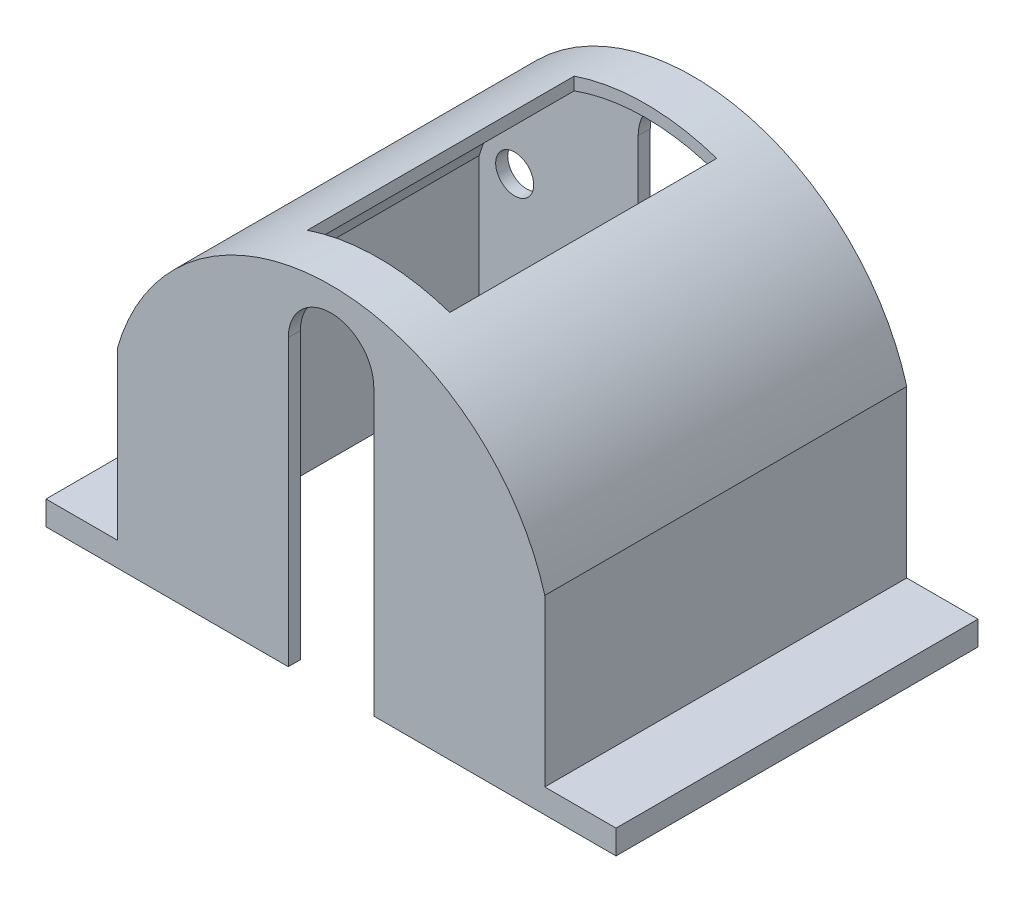
ISO-10303-21;
HEADER;
FILE_DESCRIPTION(('STEP AP214'),'2;1');
FILE_NAME('part.step','',(''),(''),'','','');
FILE_SCHEMA(('AUTOMOTIVE_DESIGN { 1 0 10303 214 1 1 1 1 }'));
ENDSEC;
DATA;
#1=APPLICATION_CONTEXT('core data for automotive mechanical design processes');
#2=APPLICATION_PROTOCOL_DEFINITION('international standard','automotive_design',2000,#1);
#3=PRODUCT_CONTEXT('',#1,'mechanical');
#4=PRODUCT('Part','Part','',(#3));
#5=PRODUCT_RELATED_PRODUCT_CATEGORY('part','',(#4));
#6=PRODUCT_DEFINITION_FORMATION('','',#4);
#7=PRODUCT_DEFINITION_CONTEXT('part definition',#1,'design');
#8=PRODUCT_DEFINITION('design','',#6,#7);
#9=PRODUCT_DEFINITION_SHAPE('','',#8);
#10=(LENGTH_UNIT() NAMED_UNIT(*) SI_UNIT(.MILLI.,.METRE.));
#11=(NAMED_UNIT(*) PLANE_ANGLE_UNIT() SI_UNIT($,.RADIAN.));
#12=(NAMED_UNIT(*) SI_UNIT($,.STERADIAN.) SOLID_ANGLE_UNIT());
#13=UNCERTAINTY_MEASURE_WITH_UNIT(LENGTH_MEASURE(1.E-05),#10,'distance_accuracy_value','');
#14=(GEOMETRIC_REPRESENTATION_CONTEXT(3) GLOBAL_UNCERTAINTY_ASSIGNED_CONTEXT((#13)) GLOBAL_UNIT_ASSIGNED_CONTEXT((#10,
#11,#12)) REPRESENTATION_CONTEXT('',''));
#15=CARTESIAN_POINT('',(0.,0.,0.));
#16=DIRECTION('',(0.,0.,1.));
#17=DIRECTION('',(1.,0.,0.));
#18=AXIS2_PLACEMENT_3D('',#15,#16,#17);
#19=CARTESIAN_POINT('',(-22.5,-20.,38.1));
#20=DIRECTION('',(0.,1.,0.));
#21=DIRECTION('',(0.,0.,1.));
#22=AXIS2_PLACEMENT_3D('',#19,#20,#21);
#23=PLANE('',#22);
#24=DIRECTION('',(0.,0.,-1.));
#25=VECTOR('',#24,1.);
#26=CARTESIAN_POINT('',(-4.5,-20.,38.1));
#27=LINE('',#26,#25);
#28=CARTESIAN_POINT('',(-4.5,-20.,38.1));
#29=VERTEX_POINT('',#28);
#30=CARTESIAN_POINT('',(-4.5,-20.,36.83));
#31=VERTEX_POINT('',#30);
#32=EDGE_CURVE('E293',#29,#31,#27,.T.);
#33=ORIENTED_EDGE('',*,*,#32,.F.);
#34=DIRECTION('',(1.,0.,0.));
#35=VECTOR('',#34,1.);
#36=CARTESIAN_POINT('',(-22.5,-20.,38.1));
#37=LINE('',#36,#35);
#38=CARTESIAN_POINT('',(-30.,-20.,38.1));
#39=VERTEX_POINT('',#38);
#40=EDGE_CURVE('E350',#39,#29,#37,.T.);
#41=ORIENTED_EDGE('',*,*,#40,.F.);
#42=DIRECTION('',(0.,0.,-1.));
#43=VECTOR('',#42,1.);
#44=CARTESIAN_POINT('',(-30.,-20.,38.1));
#45=LINE('',#44,#43);
#46=CARTESIAN_POINT('',(-30.,-20.,0.));
#47=VERTEX_POINT('',#46);
#48=EDGE_CURVE('E225',#39,#47,#45,.T.);
#49=ORIENTED_EDGE('',*,*,#48,.T.);
#50=DIRECTION('',(1.,0.,0.));
#51=VECTOR('',#50,1.);
#52=CARTESIAN_POINT('',(-22.5,-20.,0.));
#53=LINE('',#52,#51);
#54=CARTESIAN_POINT('',(-4.5,-20.,0.));
#55=VERTEX_POINT('',#54);
#56=EDGE_CURVE('E362',#47,#55,#53,.T.);
#57=ORIENTED_EDGE('',*,*,#56,.T.);
#58=CARTESIAN_POINT('',(-4.5,-20.,1.27000000000001));
#59=VERTEX_POINT('',#58);
#60=EDGE_CURVE('E295',#59,#55,#27,.T.);
#61=ORIENTED_EDGE('',*,*,#60,.F.);
#62=DIRECTION('',(1.,0.,0.));
#63=VECTOR('',#62,1.);
#64=CARTESIAN_POINT('',(0.,-20.,1.27));
#65=LINE('',#64,#63);
#66=CARTESIAN_POINT('',(-21.23,-20.,1.27));
#67=VERTEX_POINT('',#66);
#68=EDGE_CURVE('E327',#67,#59,#65,.T.);
#69=ORIENTED_EDGE('',*,*,#68,.F.);
#70=DIRECTION('',(0.,0.,-1.));
#71=VECTOR('',#70,1.);
#72=CARTESIAN_POINT('',(-21.23,-20.,38.1));
#73=LINE('',#72,#71);
#74=CARTESIAN_POINT('',(-21.23,-20.,36.83));
#75=VERTEX_POINT('',#74);
#76=EDGE_CURVE('E316',#75,#67,#73,.T.);
#77=ORIENTED_EDGE('',*,*,#76,.F.);
#78=DIRECTION('',(1.,0.,0.));
#79=VECTOR('',#78,1.);
#80=CARTESIAN_POINT('',(0.,-20.,36.83));
#81=LINE('',#80,#79);
#82=EDGE_CURVE('E330',#75,#31,#81,.T.);
#83=ORIENTED_EDGE('',*,*,#82,.T.);
#84=EDGE_LOOP('',(#33,#41,#49,#57,#61,#69,#77,#83));
#85=FACE_BOUND('',#84,.T.);
#86=ADVANCED_FACE('F35',(#85),#23,.F.);
#87=CARTESIAN_POINT('',(0.,-6.35534140969163,38.1));
#88=DIRECTION('',(0.,0.,-1.));
#89=DIRECTION('',(-1.,0.,0.));
#90=AXIS2_PLACEMENT_3D('',#87,#88,#89);
#91=PLANE('',#90);
#92=DIRECTION('',(0.,-1.,0.));
#93=VECTOR('',#92,1.);
#94=CARTESIAN_POINT('',(-4.5,10.,38.1));
#95=LINE('',#94,#93);
#96=CARTESIAN_POINT('',(-4.5,10.,38.1));
#97=VERTEX_POINT('',#96);
#98=EDGE_CURVE('E278',#97,#29,#95,.T.);
#99=ORIENTED_EDGE('',*,*,#98,.F.);
#100=CARTESIAN_POINT('',(0.,10.,38.1));
#101=DIRECTION('',(0.,0.,-1.));
#102=DIRECTION('',(-1.,0.,0.));
#103=AXIS2_PLACEMENT_3D('',#100,#101,#102);
#104=CIRCLE('',#103,4.5);
#105=CARTESIAN_POINT('',(4.5,10.,38.1));
#106=VERTEX_POINT('',#105);
#107=EDGE_CURVE('E272',#97,#106,#104,.T.);
#108=ORIENTED_EDGE('',*,*,#107,.T.);
#109=DIRECTION('',(0.,-1.,0.));
#110=VECTOR('',#109,1.);
#111=CARTESIAN_POINT('',(4.5,10.,38.1));
#112=LINE('',#111,#110);
#113=CARTESIAN_POINT('',(4.5,-20.,38.1));
#114=VERTEX_POINT('',#113);
#115=EDGE_CURVE('E275',#106,#114,#112,.T.);
#116=ORIENTED_EDGE('',*,*,#115,.T.);
#117=CARTESIAN_POINT('',(30.,-20.,38.1));
#118=VERTEX_POINT('',#117);
#119=EDGE_CURVE('E206',#114,#118,#37,.T.);
#120=ORIENTED_EDGE('',*,*,#119,.T.);
#121=DIRECTION('',(0.,-1.,0.));
#122=VECTOR('',#121,1.);
#123=CARTESIAN_POINT('',(30.,-17.46,38.1));
#124=LINE('',#123,#122);
#125=CARTESIAN_POINT('',(30.,-17.46,38.1));
#126=VERTEX_POINT('',#125);
#127=EDGE_CURVE('E198',#126,#118,#124,.T.);
#128=ORIENTED_EDGE('',*,*,#127,.F.);
#129=DIRECTION('',(-1.,0.,0.));
#130=VECTOR('',#129,1.);
#131=CARTESIAN_POINT('',(30.,-17.46,38.1));
#132=LINE('',#131,#130);
#133=CARTESIAN_POINT('',(22.5,-17.46,38.1));
#134=VERTEX_POINT('',#133);
#135=EDGE_CURVE('E202',#126,#134,#132,.T.);
#136=ORIENTED_EDGE('',*,*,#135,.T.);
#137=DIRECTION('',(0.,1.,0.));
#138=VECTOR('',#137,1.);
#139=CARTESIAN_POINT('',(22.5,-20.,38.1));
#140=LINE('',#139,#138);
#141=CARTESIAN_POINT('',(22.5,0.,38.1));
#142=VERTEX_POINT('',#141);
#143=EDGE_CURVE('E347',#134,#142,#140,.T.);
#144=ORIENTED_EDGE('',*,*,#143,.T.);
#145=CARTESIAN_POINT('',(0.,-6.35534140969163,38.1));
#146=DIRECTION('',(0.,0.,-1.));
#147=DIRECTION('',(-1.,0.,0.));
#148=AXIS2_PLACEMENT_3D('',#145,#146,#147);
#149=CIRCLE('',#148,23.3803414096916);
#150=CARTESIAN_POINT('',(-22.5,0.,38.1));
#151=VERTEX_POINT('',#150);
#152=EDGE_CURVE('E344',#151,#142,#149,.T.);
#153=ORIENTED_EDGE('',*,*,#152,.F.);
#154=DIRECTION('',(0.,-1.,0.));
#155=VECTOR('',#154,1.);
#156=CARTESIAN_POINT('',(-22.5,0.,38.1));
#157=LINE('',#156,#155);
#158=CARTESIAN_POINT('',(-22.5,-17.46,38.1));
#159=VERTEX_POINT('',#158);
#160=EDGE_CURVE('E353',#151,#159,#157,.T.);
#161=ORIENTED_EDGE('',*,*,#160,.T.);
#162=DIRECTION('',(-1.,0.,0.));
#163=VECTOR('',#162,1.);
#164=CARTESIAN_POINT('',(-22.5,-17.46,38.1));
#165=LINE('',#164,#163);
#166=CARTESIAN_POINT('',(-30.,-17.46,38.1));
#167=VERTEX_POINT('',#166);
#168=EDGE_CURVE('E58',#159,#167,#165,.T.);
#169=ORIENTED_EDGE('',*,*,#168,.T.);
#170=DIRECTION('',(0.,-1.,0.));
#171=VECTOR('',#170,1.);
#172=CARTESIAN_POINT('',(-30.,-17.46,38.1));
#173=LINE('',#172,#171);
#174=EDGE_CURVE('E236',#167,#39,#173,.T.);
#175=ORIENTED_EDGE('',*,*,#174,.T.);
#176=ORIENTED_EDGE('',*,*,#40,.T.);
#177=EDGE_LOOP('',(#99,#108,#116,#120,#128,#136,#144,#153,#161,#169,#175,#176));
#178=FACE_BOUND('',#177,.T.);
#179=ADVANCED_FACE('F201',(#178),#91,.F.);
#180=CARTESIAN_POINT('',(0.,-6.35534140969163,0.));
#181=DIRECTION('',(0.,0.,-1.));
#182=DIRECTION('',(-1.,0.,0.));
#183=AXIS2_PLACEMENT_3D('',#180,#181,#182);
#184=PLANE('',#183);
#185=CARTESIAN_POINT('',(-17.5,0.,0.));
#186=DIRECTION('',(0.,0.,-1.));
#187=DIRECTION('',(-1.,0.,0.));
#188=AXIS2_PLACEMENT_3D('',#185,#186,#187);
#189=CIRCLE('',#188,2.);
#190=CARTESIAN_POINT('',(-19.5,0.,0.));
#191=VERTEX_POINT('',#190);
#192=EDGE_CURVE('E264',#191,#191,#189,.T.);
#193=ORIENTED_EDGE('',*,*,#192,.F.);
#194=EDGE_LOOP('',(#193));
#195=FACE_BOUND('',#194,.T.);
#196=CARTESIAN_POINT('',(17.5,0.,0.));
#197=DIRECTION('',(0.,0.,-1.));
#198=DIRECTION('',(-1.,0.,0.));
#199=AXIS2_PLACEMENT_3D('',#196,#197,#198);
#200=CIRCLE('',#199,2.);
#201=CARTESIAN_POINT('',(15.5,0.,0.));
#202=VERTEX_POINT('',#201);
#203=EDGE_CURVE('E268',#202,#202,#200,.T.);
#204=ORIENTED_EDGE('',*,*,#203,.F.);
#205=EDGE_LOOP('',(#204));
#206=FACE_BOUND('',#205,.T.);
#207=CARTESIAN_POINT('',(0.,10.,0.));
#208=DIRECTION('',(0.,0.,-1.));
#209=DIRECTION('',(-1.,0.,0.));
#210=AXIS2_PLACEMENT_3D('',#207,#208,#209);
#211=CIRCLE('',#210,4.5);
#212=CARTESIAN_POINT('',(-4.5,10.,0.));
#213=VERTEX_POINT('',#212);
#214=CARTESIAN_POINT('',(4.5,10.,0.));
#215=VERTEX_POINT('',#214);
#216=EDGE_CURVE('E281',#213,#215,#211,.T.);
#217=ORIENTED_EDGE('',*,*,#216,.F.);
#218=DIRECTION('',(0.,-1.,0.));
#219=VECTOR('',#218,1.);
#220=CARTESIAN_POINT('',(-4.5,10.,0.));
#221=LINE('',#220,#219);
#222=EDGE_CURVE('E276',#213,#55,#221,.T.);
#223=ORIENTED_EDGE('',*,*,#222,.T.);
#224=ORIENTED_EDGE('',*,*,#56,.F.);
#225=DIRECTION('',(0.,-1.,0.));
#226=VECTOR('',#225,1.);
#227=CARTESIAN_POINT('',(-30.,-17.46,0.));
#228=LINE('',#227,#226);
#229=CARTESIAN_POINT('',(-30.,-17.46,0.));
#230=VERTEX_POINT('',#229);
#231=EDGE_CURVE('E239',#230,#47,#228,.T.);
#232=ORIENTED_EDGE('',*,*,#231,.F.);
#233=DIRECTION('',(1.,0.,0.));
#234=VECTOR('',#233,1.);
#235=CARTESIAN_POINT('',(-22.5,-17.46,0.));
#236=LINE('',#235,#234);
#237=CARTESIAN_POINT('',(-22.5,-17.46,0.));
#238=VERTEX_POINT('',#237);
#239=EDGE_CURVE('E233',#230,#238,#236,.T.);
#240=ORIENTED_EDGE('',*,*,#239,.T.);
#241=DIRECTION('',(0.,-1.,0.));
#242=VECTOR('',#241,1.);
#243=CARTESIAN_POINT('',(-22.5,0.,0.));
#244=LINE('',#243,#242);
#245=CARTESIAN_POINT('',(-22.5,0.,0.));
#246=VERTEX_POINT('',#245);
#247=EDGE_CURVE('E348',#246,#238,#244,.T.);
#248=ORIENTED_EDGE('',*,*,#247,.F.);
#249=CARTESIAN_POINT('',(0.,-6.35534140969163,0.));
#250=DIRECTION('',(0.,0.,-1.));
#251=DIRECTION('',(-1.,0.,0.));
#252=AXIS2_PLACEMENT_3D('',#249,#250,#251);
#253=CIRCLE('',#252,23.3803414096916);
#254=CARTESIAN_POINT('',(22.5,0.,0.));
#255=VERTEX_POINT('',#254);
#256=EDGE_CURVE('E315',#246,#255,#253,.T.);
#257=ORIENTED_EDGE('',*,*,#256,.T.);
#258=DIRECTION('',(0.,1.,0.));
#259=VECTOR('',#258,1.);
#260=CARTESIAN_POINT('',(22.5,-20.,0.));
#261=LINE('',#260,#259);
#262=CARTESIAN_POINT('',(22.5,-17.46,0.));
#263=VERTEX_POINT('',#262);
#264=EDGE_CURVE('E359',#263,#255,#261,.T.);
#265=ORIENTED_EDGE('',*,*,#264,.F.);
#266=DIRECTION('',(1.,0.,0.));
#267=VECTOR('',#266,1.);
#268=CARTESIAN_POINT('',(30.,-17.46,0.));
#269=LINE('',#268,#267);
#270=CARTESIAN_POINT('',(30.,-17.46,0.));
#271=VERTEX_POINT('',#270);
#272=EDGE_CURVE('E50',#263,#271,#269,.T.);
#273=ORIENTED_EDGE('',*,*,#272,.T.);
#274=DIRECTION('',(0.,-1.,0.));
#275=VECTOR('',#274,1.);
#276=CARTESIAN_POINT('',(30.,-17.46,0.));
#277=LINE('',#276,#275);
#278=CARTESIAN_POINT('',(30.,-20.,0.));
#279=VERTEX_POINT('',#278);
#280=EDGE_CURVE('E211',#271,#279,#277,.T.);
#281=ORIENTED_EDGE('',*,*,#280,.T.);
#282=CARTESIAN_POINT('',(4.5,-20.,0.));
#283=VERTEX_POINT('',#282);
#284=EDGE_CURVE('E361',#283,#279,#53,.T.);
#285=ORIENTED_EDGE('',*,*,#284,.F.);
#286=DIRECTION('',(0.,-1.,0.));
#287=VECTOR('',#286,1.);
#288=CARTESIAN_POINT('',(4.5,10.,0.));
#289=LINE('',#288,#287);
#290=EDGE_CURVE('E284',#215,#283,#289,.T.);
#291=ORIENTED_EDGE('',*,*,#290,.F.);
#292=EDGE_LOOP('',(#217,#223,#224,#232,#240,#248,#257,#265,#273,#281,#285,#291));
#293=FACE_BOUND('',#292,.T.);
#294=ADVANCED_FACE('F429',(#195,#206,#293),#184,.T.);
#295=CARTESIAN_POINT('',(0.,-6.35534140969163,36.83));
#296=DIRECTION('',(0.,0.,-1.));
#297=DIRECTION('',(-1.,0.,0.));
#298=AXIS2_PLACEMENT_3D('',#295,#296,#297);
#299=PLANE('',#298);
#300=CARTESIAN_POINT('',(0.,10.,36.83));
#301=DIRECTION('',(0.,0.,-1.));
#302=DIRECTION('',(-1.,0.,0.));
#303=AXIS2_PLACEMENT_3D('',#300,#301,#302);
#304=CIRCLE('',#303,4.5);
#305=CARTESIAN_POINT('',(-4.5,10.,36.83));
#306=VERTEX_POINT('',#305);
#307=CARTESIAN_POINT('',(4.5,10.,36.83));
#308=VERTEX_POINT('',#307);
#309=EDGE_CURVE('E306',#306,#308,#304,.T.);
#310=ORIENTED_EDGE('',*,*,#309,.F.);
#311=DIRECTION('',(0.,-1.,0.));
#312=VECTOR('',#311,1.);
#313=CARTESIAN_POINT('',(-4.5,-6.35534140969163,36.83));
#314=LINE('',#313,#312);
#315=EDGE_CURVE('E303',#306,#31,#314,.T.);
#316=ORIENTED_EDGE('',*,*,#315,.T.);
#317=ORIENTED_EDGE('',*,*,#82,.F.);
#318=DIRECTION('',(0.,-1.,0.));
#319=VECTOR('',#318,1.);
#320=CARTESIAN_POINT('',(-21.23,-6.35534140969163,36.83));
#321=LINE('',#320,#319);
#322=CARTESIAN_POINT('',(-21.23,-0.178424925463868,36.83));
#323=VERTEX_POINT('',#322);
#324=EDGE_CURVE('E325',#323,#75,#321,.T.);
#325=ORIENTED_EDGE('',*,*,#324,.F.);
#326=CARTESIAN_POINT('',(0.,-6.35534140969163,36.83));
#327=DIRECTION('',(0.,0.,-1.));
#328=DIRECTION('',(-1.,0.,0.));
#329=AXIS2_PLACEMENT_3D('',#326,#327,#328);
#330=CIRCLE('',#329,22.1103414096916);
#331=CARTESIAN_POINT('',(21.23,-0.178424925463868,36.83));
#332=VERTEX_POINT('',#331);
#333=EDGE_CURVE('E317',#323,#332,#330,.T.);
#334=ORIENTED_EDGE('',*,*,#333,.T.);
#335=DIRECTION('',(0.,1.,0.));
#336=VECTOR('',#335,1.);
#337=CARTESIAN_POINT('',(21.23,-6.35534140969163,36.83));
#338=LINE('',#337,#336);
#339=CARTESIAN_POINT('',(21.23,-20.,36.83));
#340=VERTEX_POINT('',#339);
#341=EDGE_CURVE('E320',#340,#332,#338,.T.);
#342=ORIENTED_EDGE('',*,*,#341,.F.);
#343=CARTESIAN_POINT('',(4.5,-20.,36.83));
#344=VERTEX_POINT('',#343);
#345=EDGE_CURVE('E332',#344,#340,#81,.T.);
#346=ORIENTED_EDGE('',*,*,#345,.F.);
#347=DIRECTION('',(0.,-1.,0.));
#348=VECTOR('',#347,1.);
#349=CARTESIAN_POINT('',(4.5,-6.35534140969163,36.83));
#350=LINE('',#349,#348);
#351=EDGE_CURVE('E291',#308,#344,#350,.T.);
#352=ORIENTED_EDGE('',*,*,#351,.F.);
#353=EDGE_LOOP('',(#310,#316,#317,#325,#334,#342,#346,#352));
#354=FACE_BOUND('',#353,.T.);
#355=ADVANCED_FACE('F441',(#354),#299,.T.);
#356=CARTESIAN_POINT('',(0.,-6.35534140969163,1.27));
#357=DIRECTION('',(0.,0.,-1.));
#358=DIRECTION('',(-1.,0.,0.));
#359=AXIS2_PLACEMENT_3D('',#356,#357,#358);
#360=PLANE('',#359);
#361=CARTESIAN_POINT('',(-17.5,0.,1.27));
#362=DIRECTION('',(0.,0.,-1.));
#363=DIRECTION('',(-1.,0.,0.));
#364=AXIS2_PLACEMENT_3D('',#361,#362,#363);
#365=CIRCLE('',#364,2.);
#366=CARTESIAN_POINT('',(-19.5,0.,1.27));
#367=VERTEX_POINT('',#366);
#368=EDGE_CURVE('E267',#367,#367,#365,.T.);
#369=ORIENTED_EDGE('',*,*,#368,.T.);
#370=EDGE_LOOP('',(#369));
#371=FACE_BOUND('',#370,.T.);
#372=CARTESIAN_POINT('',(17.5,0.,1.27));
#373=DIRECTION('',(0.,0.,-1.));
#374=DIRECTION('',(-1.,0.,0.));
#375=AXIS2_PLACEMENT_3D('',#372,#373,#374);
#376=CIRCLE('',#375,2.);
#377=CARTESIAN_POINT('',(15.5,0.,1.27));
#378=VERTEX_POINT('',#377);
#379=EDGE_CURVE('E271',#378,#378,#376,.T.);
#380=ORIENTED_EDGE('',*,*,#379,.T.);
#381=EDGE_LOOP('',(#380));
#382=FACE_BOUND('',#381,.T.);
#383=DIRECTION('',(0.,-1.,0.));
#384=VECTOR('',#383,1.);
#385=CARTESIAN_POINT('',(-4.5,-6.35534140969163,1.27));
#386=LINE('',#385,#384);
#387=CARTESIAN_POINT('',(-4.5,10.,1.27000000000001));
#388=VERTEX_POINT('',#387);
#389=EDGE_CURVE('E377',#388,#59,#386,.T.);
#390=ORIENTED_EDGE('',*,*,#389,.F.);
#391=CARTESIAN_POINT('',(0.,10.,1.27));
#392=DIRECTION('',(0.,0.,-1.));
#393=DIRECTION('',(-1.,0.,0.));
#394=AXIS2_PLACEMENT_3D('',#391,#392,#393);
#395=CIRCLE('',#394,4.5);
#396=CARTESIAN_POINT('',(4.5,10.,1.27000000000001));
#397=VERTEX_POINT('',#396);
#398=EDGE_CURVE('E374',#388,#397,#395,.T.);
#399=ORIENTED_EDGE('',*,*,#398,.T.);
#400=DIRECTION('',(0.,-1.,0.));
#401=VECTOR('',#400,1.);
#402=CARTESIAN_POINT('',(4.5,-6.35534140969163,1.27));
#403=LINE('',#402,#401);
#404=CARTESIAN_POINT('',(4.5,-20.,1.27));
#405=VERTEX_POINT('',#404);
#406=EDGE_CURVE('E369',#397,#405,#403,.T.);
#407=ORIENTED_EDGE('',*,*,#406,.T.);
#408=CARTESIAN_POINT('',(21.23,-20.,1.27));
#409=VERTEX_POINT('',#408);
#410=EDGE_CURVE('E335',#405,#409,#65,.T.);
#411=ORIENTED_EDGE('',*,*,#410,.T.);
#412=DIRECTION('',(0.,1.,0.));
#413=VECTOR('',#412,1.);
#414=CARTESIAN_POINT('',(21.23,-6.35534140969163,1.27));
#415=LINE('',#414,#413);
#416=CARTESIAN_POINT('',(21.23,-0.178424925463866,1.27));
#417=VERTEX_POINT('',#416);
#418=EDGE_CURVE('E312',#409,#417,#415,.T.);
#419=ORIENTED_EDGE('',*,*,#418,.T.);
#420=CARTESIAN_POINT('',(0.,-6.35534140969163,1.27));
#421=DIRECTION('',(0.,0.,-1.));
#422=DIRECTION('',(-1.,0.,0.));
#423=AXIS2_PLACEMENT_3D('',#420,#421,#422);
#424=CIRCLE('',#423,22.1103414096916);
#425=CARTESIAN_POINT('',(-21.23,-0.178424925463866,1.27));
#426=VERTEX_POINT('',#425);
#427=EDGE_CURVE('E309',#426,#417,#424,.T.);
#428=ORIENTED_EDGE('',*,*,#427,.F.);
#429=DIRECTION('',(0.,-1.,0.));
#430=VECTOR('',#429,1.);
#431=CARTESIAN_POINT('',(-21.23,-6.35534140969163,1.27));
#432=LINE('',#431,#430);
#433=EDGE_CURVE('E321',#426,#67,#432,.T.);
#434=ORIENTED_EDGE('',*,*,#433,.T.);
#435=ORIENTED_EDGE('',*,*,#68,.T.);
#436=EDGE_LOOP('',(#390,#399,#407,#411,#419,#428,#434,#435));
#437=FACE_BOUND('',#436,.T.);
#438=ADVANCED_FACE('F434',(#371,#382,#437),#360,.F.);
#439=ORIENTED_EDGE('',*,*,#119,.F.);
#440=DIRECTION('',(0.,0.,-1.));
#441=VECTOR('',#440,1.);
#442=CARTESIAN_POINT('',(4.5,-20.,38.1));
#443=LINE('',#442,#441);
#444=EDGE_CURVE('E296',#114,#344,#443,.T.);
#445=ORIENTED_EDGE('',*,*,#444,.T.);
#446=ORIENTED_EDGE('',*,*,#345,.T.);
#447=DIRECTION('',(0.,0.,-1.));
#448=VECTOR('',#447,1.);
#449=CARTESIAN_POINT('',(21.23,-20.,38.1));
#450=LINE('',#449,#448);
#451=EDGE_CURVE('E324',#340,#409,#450,.T.);
#452=ORIENTED_EDGE('',*,*,#451,.T.);
#453=ORIENTED_EDGE('',*,*,#410,.F.);
#454=EDGE_CURVE('E299',#405,#283,#443,.T.);
#455=ORIENTED_EDGE('',*,*,#454,.T.);
#456=ORIENTED_EDGE('',*,*,#284,.T.);
#457=DIRECTION('',(0.,0.,1.));
#458=VECTOR('',#457,1.);
#459=CARTESIAN_POINT('',(30.,-20.,38.1));
#460=LINE('',#459,#458);
#461=EDGE_CURVE('E219',#279,#118,#460,.T.);
#462=ORIENTED_EDGE('',*,*,#461,.T.);
#463=EDGE_LOOP('',(#439,#445,#446,#452,#453,#455,#456,#462));
#464=FACE_BOUND('',#463,.T.);
#465=ADVANCED_FACE('F425',(#464),#23,.F.);
#466=CARTESIAN_POINT('',(0.,-6.35534140969163,38.1));
#467=DIRECTION('',(0.,0.,-1.));
#468=DIRECTION('',(-1.,0.,0.));
#469=AXIS2_PLACEMENT_3D('',#466,#467,#468);
#470=CYLINDRICAL_SURFACE('',#469,23.3803414096916);
#471=CARTESIAN_POINT('',(0.,-6.35534140969163,33.1));
#472=DIRECTION('',(0.,0.,1.));
#473=DIRECTION('',(1.,0.,0.));
#474=AXIS2_PLACEMENT_3D('',#471,#472,#473);
#475=CIRCLE('',#474,23.3803414096916);
#476=CARTESIAN_POINT('',(-7.5,15.7894178898298,33.1));
#477=VERTEX_POINT('',#476);
#478=CARTESIAN_POINT('',(7.5,15.7894178898298,33.1));
#479=VERTEX_POINT('',#478);
#480=EDGE_CURVE('E248',#477,#479,#475,.F.);
#481=ORIENTED_EDGE('',*,*,#480,.F.);
#482=DIRECTION('',(0.,0.,-1.));
#483=VECTOR('',#482,1.);
#484=CARTESIAN_POINT('',(-7.5,15.7894178898298,38.1));
#485=LINE('',#484,#483);
#486=CARTESIAN_POINT('',(-7.49999999999999,15.7894178898298,5.00000000000001));
#487=VERTEX_POINT('',#486);
#488=EDGE_CURVE('E262',#487,#477,#485,.F.);
#489=ORIENTED_EDGE('',*,*,#488,.F.);
#490=CARTESIAN_POINT('',(0.,-6.35534140969163,5.));
#491=DIRECTION('',(0.,0.,-1.));
#492=DIRECTION('',(-1.,0.,0.));
#493=AXIS2_PLACEMENT_3D('',#490,#491,#492);
#494=CIRCLE('',#493,23.3803414096916);
#495=CARTESIAN_POINT('',(7.5,15.7894178898298,5.));
#496=VERTEX_POINT('',#495);
#497=EDGE_CURVE('E260',#496,#487,#494,.F.);
#498=ORIENTED_EDGE('',*,*,#497,.F.);
#499=DIRECTION('',(0.,0.,-1.));
#500=VECTOR('',#499,1.);
#501=CARTESIAN_POINT('',(7.50000000000001,15.7894178898298,38.1));
#502=LINE('',#501,#500);
#503=EDGE_CURVE('E258',#479,#496,#502,.T.);
#504=ORIENTED_EDGE('',*,*,#503,.F.);
#505=EDGE_LOOP('',(#481,#489,#498,#504));
#506=FACE_BOUND('',#505,.T.);
#507=ORIENTED_EDGE('',*,*,#256,.F.);
#508=DIRECTION('',(0.,0.,-1.));
#509=VECTOR('',#508,1.);
#510=CARTESIAN_POINT('',(-22.5,0.,38.1));
#511=LINE('',#510,#509);
#512=EDGE_CURVE('E367',#151,#246,#511,.T.);
#513=ORIENTED_EDGE('',*,*,#512,.F.);
#514=ORIENTED_EDGE('',*,*,#152,.T.);
#515=DIRECTION('',(0.,0.,-1.));
#516=VECTOR('',#515,1.);
#517=CARTESIAN_POINT('',(22.5,0.,38.1));
#518=LINE('',#517,#516);
#519=EDGE_CURVE('E356',#142,#255,#518,.T.);
#520=ORIENTED_EDGE('',*,*,#519,.T.);
#521=EDGE_LOOP('',(#507,#513,#514,#520));
#522=FACE_BOUND('',#521,.T.);
#523=ADVANCED_FACE('F37',(#506,#522),#470,.T.);
#524=CARTESIAN_POINT('',(-22.5,0.,38.1));
#525=DIRECTION('',(1.,0.,0.));
#526=DIRECTION('',(0.,0.,-1.));
#527=AXIS2_PLACEMENT_3D('',#524,#525,#526);
#528=PLANE('',#527);
#529=ORIENTED_EDGE('',*,*,#247,.T.);
#530=DIRECTION('',(0.,0.,1.));
#531=VECTOR('',#530,1.);
#532=CARTESIAN_POINT('',(-22.5,-17.46,38.1));
#533=LINE('',#532,#531);
#534=EDGE_CURVE('E227',#238,#159,#533,.T.);
#535=ORIENTED_EDGE('',*,*,#534,.T.);
#536=ORIENTED_EDGE('',*,*,#160,.F.);
#537=ORIENTED_EDGE('',*,*,#512,.T.);
#538=EDGE_LOOP('',(#529,#535,#536,#537));
#539=FACE_BOUND('',#538,.T.);
#540=ADVANCED_FACE('F440',(#539),#528,.F.);
#541=CARTESIAN_POINT('',(22.5,-20.,38.1));
#542=DIRECTION('',(-1.,0.,0.));
#543=DIRECTION('',(0.,0.,1.));
#544=AXIS2_PLACEMENT_3D('',#541,#542,#543);
#545=PLANE('',#544);
#546=ORIENTED_EDGE('',*,*,#143,.F.);
#547=DIRECTION('',(0.,0.,-1.));
#548=VECTOR('',#547,1.);
#549=CARTESIAN_POINT('',(22.5,-17.46,38.1));
#550=LINE('',#549,#548);
#551=EDGE_CURVE('E215',#134,#263,#550,.T.);
#552=ORIENTED_EDGE('',*,*,#551,.T.);
#553=ORIENTED_EDGE('',*,*,#264,.T.);
#554=ORIENTED_EDGE('',*,*,#519,.F.);
#555=EDGE_LOOP('',(#546,#552,#553,#554));
#556=FACE_BOUND('',#555,.T.);
#557=ADVANCED_FACE('F456',(#556),#545,.F.);
#558=CARTESIAN_POINT('',(0.,-6.35534140969163,38.1));
#559=DIRECTION('',(0.,0.,-1.));
#560=DIRECTION('',(-1.,0.,0.));
#561=AXIS2_PLACEMENT_3D('',#558,#559,#560);
#562=CYLINDRICAL_SURFACE('',#561,22.1103414096916);
#563=CARTESIAN_POINT('',(0.,-6.35534140969163,5.));
#564=DIRECTION('',(0.,0.,-1.));
#565=DIRECTION('',(-1.,0.,0.));
#566=AXIS2_PLACEMENT_3D('',#563,#564,#565);
#567=CIRCLE('',#566,22.1103414096916);
#568=CARTESIAN_POINT('',(7.5,14.4441104401318,5.));
#569=VERTEX_POINT('',#568);
#570=CARTESIAN_POINT('',(-7.49999999999999,14.4441104401318,5.00000000000001));
#571=VERTEX_POINT('',#570);
#572=EDGE_CURVE('E43',#569,#571,#567,.F.);
#573=ORIENTED_EDGE('',*,*,#572,.T.);
#574=DIRECTION('',(0.,0.,-1.));
#575=VECTOR('',#574,1.);
#576=CARTESIAN_POINT('',(-7.5,14.4441104401318,38.1));
#577=LINE('',#576,#575);
#578=CARTESIAN_POINT('',(-7.5,14.4441104401318,33.1));
#579=VERTEX_POINT('',#578);
#580=EDGE_CURVE('E11',#571,#579,#577,.F.);
#581=ORIENTED_EDGE('',*,*,#580,.T.);
#582=CARTESIAN_POINT('',(0.,-6.35534140969163,33.1));
#583=DIRECTION('',(0.,0.,1.));
#584=DIRECTION('',(1.,0.,0.));
#585=AXIS2_PLACEMENT_3D('',#582,#583,#584);
#586=CIRCLE('',#585,22.1103414096916);
#587=CARTESIAN_POINT('',(7.5,14.4441104401318,33.1));
#588=VERTEX_POINT('',#587);
#589=EDGE_CURVE('E379',#579,#588,#586,.F.);
#590=ORIENTED_EDGE('',*,*,#589,.T.);
#591=DIRECTION('',(0.,0.,-1.));
#592=VECTOR('',#591,1.);
#593=CARTESIAN_POINT('',(7.50000000000001,14.4441104401318,38.1));
#594=LINE('',#593,#592);
#595=EDGE_CURVE('E386',#588,#569,#594,.T.);
#596=ORIENTED_EDGE('',*,*,#595,.T.);
#597=EDGE_LOOP('',(#573,#581,#590,#596));
#598=FACE_BOUND('',#597,.T.);
#599=ORIENTED_EDGE('',*,*,#427,.T.);
#600=DIRECTION('',(0.,0.,-1.));
#601=VECTOR('',#600,1.);
#602=CARTESIAN_POINT('',(21.23,-0.178424925463868,36.83));
#603=LINE('',#602,#601);
#604=EDGE_CURVE('E322',#332,#417,#603,.T.);
#605=ORIENTED_EDGE('',*,*,#604,.F.);
#606=ORIENTED_EDGE('',*,*,#333,.F.);
#607=DIRECTION('',(0.,0.,-1.));
#608=VECTOR('',#607,1.);
#609=CARTESIAN_POINT('',(-21.23,-0.178424925463868,36.83));
#610=LINE('',#609,#608);
#611=EDGE_CURVE('E313',#323,#426,#610,.T.);
#612=ORIENTED_EDGE('',*,*,#611,.T.);
#613=EDGE_LOOP('',(#599,#605,#606,#612));
#614=FACE_BOUND('',#613,.T.);
#615=ADVANCED_FACE('F390',(#598,#614),#562,.F.);
#616=CARTESIAN_POINT('',(-21.23,0.,38.1));
#617=DIRECTION('',(1.,0.,0.));
#618=DIRECTION('',(0.,0.,-1.));
#619=AXIS2_PLACEMENT_3D('',#616,#617,#618);
#620=PLANE('',#619);
#621=ORIENTED_EDGE('',*,*,#433,.F.);
#622=ORIENTED_EDGE('',*,*,#611,.F.);
#623=ORIENTED_EDGE('',*,*,#324,.T.);
#624=ORIENTED_EDGE('',*,*,#76,.T.);
#625=EDGE_LOOP('',(#621,#622,#623,#624));
#626=FACE_BOUND('',#625,.T.);
#627=ADVANCED_FACE('F498',(#626),#620,.T.);
#628=CARTESIAN_POINT('',(21.23,-20.,38.1));
#629=DIRECTION('',(-1.,0.,0.));
#630=DIRECTION('',(0.,0.,1.));
#631=AXIS2_PLACEMENT_3D('',#628,#629,#630);
#632=PLANE('',#631);
#633=ORIENTED_EDGE('',*,*,#418,.F.);
#634=ORIENTED_EDGE('',*,*,#451,.F.);
#635=ORIENTED_EDGE('',*,*,#341,.T.);
#636=ORIENTED_EDGE('',*,*,#604,.T.);
#637=EDGE_LOOP('',(#633,#634,#635,#636));
#638=FACE_BOUND('',#637,.T.);
#639=ADVANCED_FACE('F490',(#638),#632,.T.);
#640=CARTESIAN_POINT('',(4.5,10.,38.1));
#641=DIRECTION('',(1.,0.,0.));
#642=DIRECTION('',(0.,1.,0.));
#643=AXIS2_PLACEMENT_3D('',#640,#641,#642);
#644=PLANE('',#643);
#645=DIRECTION('',(0.,0.,-1.));
#646=VECTOR('',#645,1.);
#647=CARTESIAN_POINT('',(4.5,10.,38.1));
#648=LINE('',#647,#646);
#649=EDGE_CURVE('E280',#397,#215,#648,.T.);
#650=ORIENTED_EDGE('',*,*,#649,.T.);
#651=ORIENTED_EDGE('',*,*,#290,.T.);
#652=ORIENTED_EDGE('',*,*,#454,.F.);
#653=ORIENTED_EDGE('',*,*,#406,.F.);
#654=EDGE_LOOP('',(#650,#651,#652,#653));
#655=FACE_BOUND('',#654,.T.);
#656=ADVANCED_FACE('F478',(#655),#644,.F.);
#657=CARTESIAN_POINT('',(-4.5,10.,38.1));
#658=DIRECTION('',(1.,0.,0.));
#659=DIRECTION('',(0.,1.,0.));
#660=AXIS2_PLACEMENT_3D('',#657,#658,#659);
#661=PLANE('',#660);
#662=ORIENTED_EDGE('',*,*,#389,.T.);
#663=ORIENTED_EDGE('',*,*,#60,.T.);
#664=ORIENTED_EDGE('',*,*,#222,.F.);
#665=DIRECTION('',(0.,0.,-1.));
#666=VECTOR('',#665,1.);
#667=CARTESIAN_POINT('',(-4.5,10.,38.1));
#668=LINE('',#667,#666);
#669=EDGE_CURVE('E292',#388,#213,#668,.T.);
#670=ORIENTED_EDGE('',*,*,#669,.F.);
#671=EDGE_LOOP('',(#662,#663,#664,#670));
#672=FACE_BOUND('',#671,.T.);
#673=ADVANCED_FACE('F487',(#672),#661,.T.);
#674=CARTESIAN_POINT('',(0.,10.,38.1));
#675=DIRECTION('',(0.,0.,-1.));
#676=DIRECTION('',(-1.,0.,0.));
#677=AXIS2_PLACEMENT_3D('',#674,#675,#676);
#678=CYLINDRICAL_SURFACE('',#677,4.5);
#679=ORIENTED_EDGE('',*,*,#669,.T.);
#680=ORIENTED_EDGE('',*,*,#216,.T.);
#681=ORIENTED_EDGE('',*,*,#649,.F.);
#682=ORIENTED_EDGE('',*,*,#398,.F.);
#683=EDGE_LOOP('',(#679,#680,#681,#682));
#684=FACE_BOUND('',#683,.T.);
#685=ADVANCED_FACE('F496',(#684),#678,.F.);
#686=ORIENTED_EDGE('',*,*,#309,.T.);
#687=EDGE_CURVE('E300',#106,#308,#648,.T.);
#688=ORIENTED_EDGE('',*,*,#687,.F.);
#689=ORIENTED_EDGE('',*,*,#107,.F.);
#690=EDGE_CURVE('E288',#97,#306,#668,.T.);
#691=ORIENTED_EDGE('',*,*,#690,.T.);
#692=EDGE_LOOP('',(#686,#688,#689,#691));
#693=FACE_BOUND('',#692,.T.);
#694=ADVANCED_FACE('F470',(#693),#678,.F.);
#695=ORIENTED_EDGE('',*,*,#690,.F.);
#696=ORIENTED_EDGE('',*,*,#98,.T.);
#697=ORIENTED_EDGE('',*,*,#32,.T.);
#698=ORIENTED_EDGE('',*,*,#315,.F.);
#699=EDGE_LOOP('',(#695,#696,#697,#698));
#700=FACE_BOUND('',#699,.T.);
#701=ADVANCED_FACE('F464',(#700),#661,.T.);
#702=ORIENTED_EDGE('',*,*,#351,.T.);
#703=ORIENTED_EDGE('',*,*,#444,.F.);
#704=ORIENTED_EDGE('',*,*,#115,.F.);
#705=ORIENTED_EDGE('',*,*,#687,.T.);
#706=EDGE_LOOP('',(#702,#703,#704,#705));
#707=FACE_BOUND('',#706,.T.);
#708=ADVANCED_FACE('F474',(#707),#644,.F.);
#709=CARTESIAN_POINT('',(17.5,0.,2.54));
#710=DIRECTION('',(0.,0.,-1.));
#711=DIRECTION('',(-1.,0.,0.));
#712=AXIS2_PLACEMENT_3D('',#709,#710,#711);
#713=CYLINDRICAL_SURFACE('',#712,2.);
#714=ORIENTED_EDGE('',*,*,#203,.T.);
#715=EDGE_LOOP('',(#714));
#716=FACE_BOUND('',#715,.T.);
#717=ORIENTED_EDGE('',*,*,#379,.F.);
#718=EDGE_LOOP('',(#717));
#719=FACE_BOUND('',#718,.T.);
#720=ADVANCED_FACE('F476',(#716,#719),#713,.F.);
#721=CARTESIAN_POINT('',(-17.5,0.,2.54));
#722=DIRECTION('',(0.,0.,-1.));
#723=DIRECTION('',(-1.,0.,0.));
#724=AXIS2_PLACEMENT_3D('',#721,#722,#723);
#725=CYLINDRICAL_SURFACE('',#724,2.);
#726=ORIENTED_EDGE('',*,*,#192,.T.);
#727=EDGE_LOOP('',(#726));
#728=FACE_BOUND('',#727,.T.);
#729=ORIENTED_EDGE('',*,*,#368,.F.);
#730=EDGE_LOOP('',(#729));
#731=FACE_BOUND('',#730,.T.);
#732=ADVANCED_FACE('F483',(#728,#731),#725,.F.);
#733=CARTESIAN_POINT('',(-7.5,-20.,33.1));
#734=DIRECTION('',(-1.,0.,0.));
#735=DIRECTION('',(0.,0.,1.));
#736=AXIS2_PLACEMENT_3D('',#733,#734,#735);
#737=PLANE('',#736);
#738=ORIENTED_EDGE('',*,*,#488,.T.);
#739=DIRECTION('',(0.,1.,0.));
#740=VECTOR('',#739,1.);
#741=CARTESIAN_POINT('',(-7.5,-20.,33.1));
#742=LINE('',#741,#740);
#743=EDGE_CURVE('E242',#579,#477,#742,.T.);
#744=ORIENTED_EDGE('',*,*,#743,.F.);
#745=ORIENTED_EDGE('',*,*,#580,.F.);
#746=DIRECTION('',(0.,1.,0.));
#747=VECTOR('',#746,1.);
#748=CARTESIAN_POINT('',(-7.49999999999999,-20.,5.));
#749=LINE('',#748,#747);
#750=EDGE_CURVE('E245',#571,#487,#749,.T.);
#751=ORIENTED_EDGE('',*,*,#750,.T.);
#752=EDGE_LOOP('',(#738,#744,#745,#751));
#753=FACE_BOUND('',#752,.T.);
#754=ADVANCED_FACE('F406',(#753),#737,.F.);
#755=CARTESIAN_POINT('',(-7.49999999999999,-20.,5.));
#756=DIRECTION('',(0.,0.,-1.));
#757=DIRECTION('',(-1.,0.,0.));
#758=AXIS2_PLACEMENT_3D('',#755,#756,#757);
#759=PLANE('',#758);
#760=ORIENTED_EDGE('',*,*,#497,.T.);
#761=ORIENTED_EDGE('',*,*,#750,.F.);
#762=ORIENTED_EDGE('',*,*,#572,.F.);
#763=DIRECTION('',(0.,1.,0.));
#764=VECTOR('',#763,1.);
#765=CARTESIAN_POINT('',(7.5,-20.,5.));
#766=LINE('',#765,#764);
#767=EDGE_CURVE('E249',#569,#496,#766,.T.);
#768=ORIENTED_EDGE('',*,*,#767,.T.);
#769=EDGE_LOOP('',(#760,#761,#762,#768));
#770=FACE_BOUND('',#769,.T.);
#771=ADVANCED_FACE('F396',(#770),#759,.F.);
#772=CARTESIAN_POINT('',(7.5,-20.,33.1));
#773=DIRECTION('',(1.,0.,0.));
#774=DIRECTION('',(0.,0.,-1.));
#775=AXIS2_PLACEMENT_3D('',#772,#773,#774);
#776=PLANE('',#775);
#777=ORIENTED_EDGE('',*,*,#503,.T.);
#778=ORIENTED_EDGE('',*,*,#767,.F.);
#779=ORIENTED_EDGE('',*,*,#595,.F.);
#780=DIRECTION('',(0.,1.,0.));
#781=VECTOR('',#780,1.);
#782=CARTESIAN_POINT('',(7.5,-20.,33.1));
#783=LINE('',#782,#781);
#784=EDGE_CURVE('E252',#588,#479,#783,.T.);
#785=ORIENTED_EDGE('',*,*,#784,.T.);
#786=EDGE_LOOP('',(#777,#778,#779,#785));
#787=FACE_BOUND('',#786,.T.);
#788=ADVANCED_FACE('F399',(#787),#776,.F.);
#789=CARTESIAN_POINT('',(-7.5,-20.,33.1));
#790=DIRECTION('',(0.,0.,1.));
#791=DIRECTION('',(1.,0.,0.));
#792=AXIS2_PLACEMENT_3D('',#789,#790,#791);
#793=PLANE('',#792);
#794=ORIENTED_EDGE('',*,*,#480,.T.);
#795=ORIENTED_EDGE('',*,*,#784,.F.);
#796=ORIENTED_EDGE('',*,*,#589,.F.);
#797=ORIENTED_EDGE('',*,*,#743,.T.);
#798=EDGE_LOOP('',(#794,#795,#796,#797));
#799=FACE_BOUND('',#798,.T.);
#800=ADVANCED_FACE('F409',(#799),#793,.F.);
#801=CARTESIAN_POINT('',(-30.,-17.46,38.1));
#802=DIRECTION('',(-1.,0.,0.));
#803=DIRECTION('',(0.,0.,1.));
#804=AXIS2_PLACEMENT_3D('',#801,#802,#803);
#805=PLANE('',#804);
#806=ORIENTED_EDGE('',*,*,#48,.F.);
#807=ORIENTED_EDGE('',*,*,#174,.F.);
#808=DIRECTION('',(0.,0.,-1.));
#809=VECTOR('',#808,1.);
#810=CARTESIAN_POINT('',(-30.,-17.46,38.1));
#811=LINE('',#810,#809);
#812=EDGE_CURVE('E230',#167,#230,#811,.T.);
#813=ORIENTED_EDGE('',*,*,#812,.T.);
#814=ORIENTED_EDGE('',*,*,#231,.T.);
#815=EDGE_LOOP('',(#806,#807,#813,#814));
#816=FACE_BOUND('',#815,.T.);
#817=ADVANCED_FACE('F411',(#816),#805,.T.);
#818=CARTESIAN_POINT('',(0.,-17.46,0.));
#819=DIRECTION('',(0.,1.,0.));
#820=DIRECTION('',(0.,0.,1.));
#821=AXIS2_PLACEMENT_3D('',#818,#819,#820);
#822=PLANE('',#821);
#823=ORIENTED_EDGE('',*,*,#534,.F.);
#824=ORIENTED_EDGE('',*,*,#239,.F.);
#825=ORIENTED_EDGE('',*,*,#812,.F.);
#826=ORIENTED_EDGE('',*,*,#168,.F.);
#827=EDGE_LOOP('',(#823,#824,#825,#826));
#828=FACE_BOUND('',#827,.T.);
#829=ADVANCED_FACE('F417',(#828),#822,.T.);
#830=CARTESIAN_POINT('',(30.,-17.46,38.1));
#831=DIRECTION('',(1.,0.,0.));
#832=DIRECTION('',(0.,0.,-1.));
#833=AXIS2_PLACEMENT_3D('',#830,#831,#832);
#834=PLANE('',#833);
#835=ORIENTED_EDGE('',*,*,#461,.F.);
#836=ORIENTED_EDGE('',*,*,#280,.F.);
#837=DIRECTION('',(0.,0.,1.));
#838=VECTOR('',#837,1.);
#839=CARTESIAN_POINT('',(30.,-17.46,38.1));
#840=LINE('',#839,#838);
#841=EDGE_CURVE('E214',#271,#126,#840,.T.);
#842=ORIENTED_EDGE('',*,*,#841,.T.);
#843=ORIENTED_EDGE('',*,*,#127,.T.);
#844=EDGE_LOOP('',(#835,#836,#842,#843));
#845=FACE_BOUND('',#844,.T.);
#846=ADVANCED_FACE('F217',(#845),#834,.T.);
#847=CARTESIAN_POINT('',(0.,-17.46,0.));
#848=DIRECTION('',(0.,1.,0.));
#849=DIRECTION('',(0.,0.,1.));
#850=AXIS2_PLACEMENT_3D('',#847,#848,#849);
#851=PLANE('',#850);
#852=ORIENTED_EDGE('',*,*,#841,.F.);
#853=ORIENTED_EDGE('',*,*,#272,.F.);
#854=ORIENTED_EDGE('',*,*,#551,.F.);
#855=ORIENTED_EDGE('',*,*,#135,.F.);
#856=EDGE_LOOP('',(#852,#853,#854,#855));
#857=FACE_BOUND('',#856,.T.);
#858=ADVANCED_FACE('F213',(#857),#851,.T.);
#859=CLOSED_SHELL('',(#86,#179,#294,#355,#438,#465,#523,#540,#557,#615,#627,#639,#656,#673,#685,
#694,#701,#708,#720,#732,#754,#771,#788,#800,#817,#829,#846,#858));
#860=MANIFOLD_SOLID_BREP('B2',#859);
#861=ADVANCED_BREP_SHAPE_REPRESENTATION('',(#18,#860),#14);
#862=SHAPE_DEFINITION_REPRESENTATION(#9,#861);
ENDSEC;
END-ISO-10303-21;
